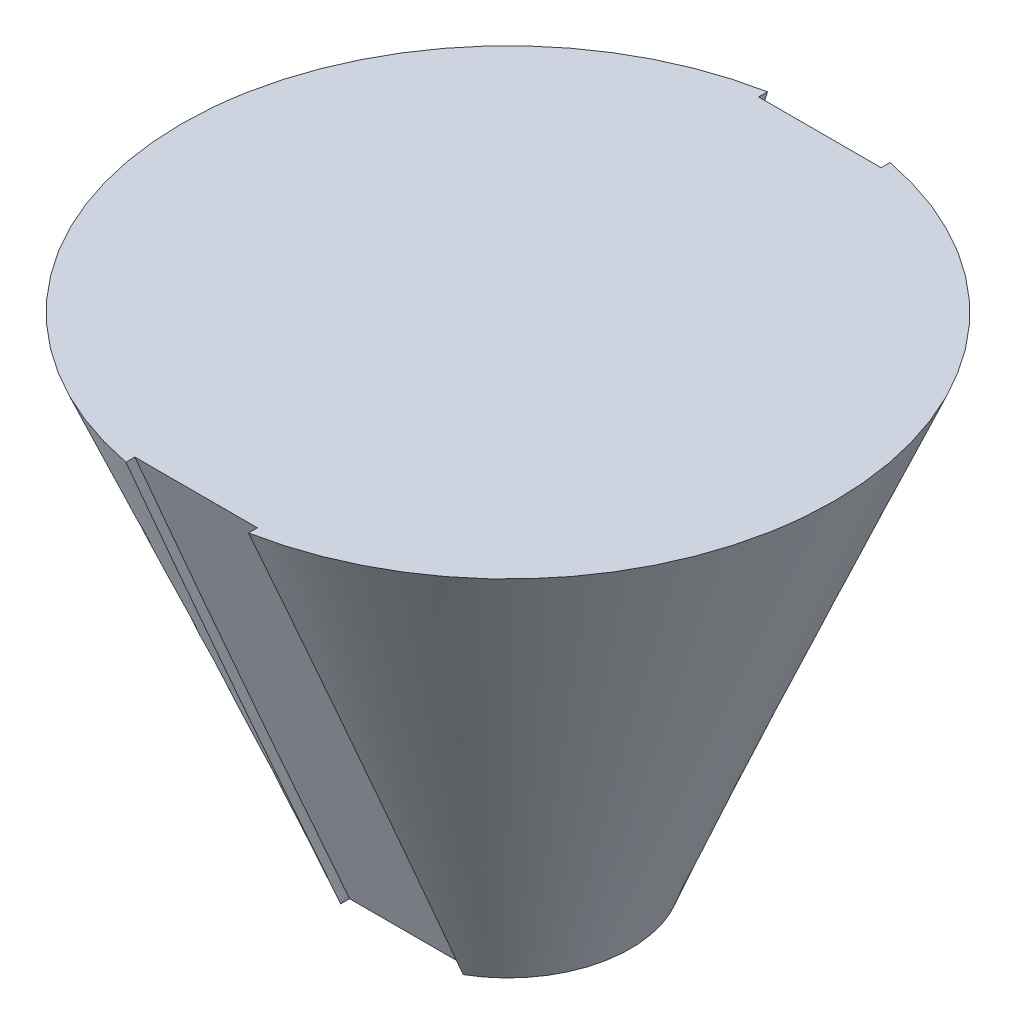
ISO-10303-21;
HEADER;
FILE_DESCRIPTION(('STEP AP214'),'2;1');
FILE_NAME('part.step','',(''),(''),'','','');
FILE_SCHEMA(('AUTOMOTIVE_DESIGN { 1 0 10303 214 1 1 1 1 }'));
ENDSEC;
DATA;
#1=APPLICATION_CONTEXT('core data for automotive mechanical design processes');
#2=APPLICATION_PROTOCOL_DEFINITION('international standard','automotive_design',2000,#1);
#3=PRODUCT_CONTEXT('',#1,'mechanical');
#4=PRODUCT('Part','Part','',(#3));
#5=PRODUCT_RELATED_PRODUCT_CATEGORY('part','',(#4));
#6=PRODUCT_DEFINITION_FORMATION('','',#4);
#7=PRODUCT_DEFINITION_CONTEXT('part definition',#1,'design');
#8=PRODUCT_DEFINITION('design','',#6,#7);
#9=PRODUCT_DEFINITION_SHAPE('','',#8);
#10=(LENGTH_UNIT() NAMED_UNIT(*) SI_UNIT(.MILLI.,.METRE.));
#11=(NAMED_UNIT(*) PLANE_ANGLE_UNIT() SI_UNIT($,.RADIAN.));
#12=(NAMED_UNIT(*) SI_UNIT($,.STERADIAN.) SOLID_ANGLE_UNIT());
#13=UNCERTAINTY_MEASURE_WITH_UNIT(LENGTH_MEASURE(1.E-05),#10,'distance_accuracy_value','');
#14=(GEOMETRIC_REPRESENTATION_CONTEXT(3) GLOBAL_UNCERTAINTY_ASSIGNED_CONTEXT((#13)) GLOBAL_UNIT_ASSIGNED_CONTEXT((#10,
#11,#12)) REPRESENTATION_CONTEXT('',''));
#15=CARTESIAN_POINT('',(0.,0.,0.));
#16=DIRECTION('',(0.,0.,1.));
#17=DIRECTION('',(1.,0.,0.));
#18=AXIS2_PLACEMENT_3D('',#15,#16,#17);
#19=CARTESIAN_POINT('',(0.,0.,0.));
#20=DIRECTION('',(0.,1.,0.));
#21=DIRECTION('',(0.,0.,1.));
#22=AXIS2_PLACEMENT_3D('',#19,#20,#21);
#23=PLANE('',#22);
#24=DIRECTION('',(7.33036834561082E-09,0.,1.));
#25=VECTOR('',#24,1.);
#26=CARTESIAN_POINT('',(19.0499995983419,0.,-1.39643514039585E-07));
#27=LINE('',#26,#25);
#28=CARTESIAN_POINT('',(19.0499998198823,0.,30.2222657953958));
#29=VERTEX_POINT('',#28);
#30=CARTESIAN_POINT('',(19.0499998402116,-1.01759319720562E-07,32.9955678395823));
#31=VERTEX_POINT('',#30);
#32=EDGE_CURVE('E406',#29,#31,#27,.T.);
#33=ORIENTED_EDGE('',*,*,#32,.F.);
#34=DIRECTION('',(1.,0.,0.));
#35=VECTOR('',#34,1.);
#36=CARTESIAN_POINT('',(0.,0.,30.2222657953958));
#37=LINE('',#36,#35);
#38=CARTESIAN_POINT('',(-19.0500008609993,0.,30.2222657953958));
#39=VERTEX_POINT('',#38);
#40=EDGE_CURVE('E155',#39,#29,#37,.T.);
#41=ORIENTED_EDGE('',*,*,#40,.F.);
#42=DIRECTION('',(-7.3303695966274E-09,0.,-1.));
#43=VECTOR('',#42,1.);
#44=CARTESIAN_POINT('',(-19.0500010825397,0.,1.39643548751168E-07));
#45=LINE('',#44,#43);
#46=CARTESIAN_POINT('',(-19.05000084067,5.35392613923436E-07,32.9955681188694));
#47=VERTEX_POINT('',#46);
#48=EDGE_CURVE('E131',#47,#39,#45,.T.);
#49=ORIENTED_EDGE('',*,*,#48,.F.);
#50=CARTESIAN_POINT('',(0.,0.,0.));
#51=DIRECTION('',(0.,1.,0.));
#52=DIRECTION('',(0.,0.,1.));
#53=AXIS2_PLACEMENT_3D('',#50,#51,#52);
#54=CIRCLE('',#53,38.1);
#55=CARTESIAN_POINT('',(-19.05000084067,5.35392613923436E-07,-32.9955681188694));
#56=VERTEX_POINT('',#55);
#57=EDGE_CURVE('E360',#56,#47,#54,.T.);
#58=ORIENTED_EDGE('',*,*,#57,.F.);
#59=DIRECTION('',(-7.33036959662741E-09,0.,1.));
#60=VECTOR('',#59,1.);
#61=CARTESIAN_POINT('',(-19.0500010825397,0.,-1.39643548751168E-07));
#62=LINE('',#61,#60);
#63=CARTESIAN_POINT('',(-19.0500008609993,0.,-30.2222657953958));
#64=VERTEX_POINT('',#63);
#65=EDGE_CURVE('E377',#56,#64,#62,.T.);
#66=ORIENTED_EDGE('',*,*,#65,.T.);
#67=DIRECTION('',(1.,0.,0.));
#68=VECTOR('',#67,1.);
#69=CARTESIAN_POINT('',(0.,0.,-30.2222657953958));
#70=LINE('',#69,#68);
#71=CARTESIAN_POINT('',(19.0499998198823,0.,-30.2222657953958));
#72=VERTEX_POINT('',#71);
#73=EDGE_CURVE('E272',#64,#72,#70,.T.);
#74=ORIENTED_EDGE('',*,*,#73,.T.);
#75=DIRECTION('',(7.33036834561082E-09,0.,-1.));
#76=VECTOR('',#75,1.);
#77=CARTESIAN_POINT('',(19.0499995983419,0.,1.39643514039585E-07));
#78=LINE('',#77,#76);
#79=CARTESIAN_POINT('',(19.0499998402116,-1.01759319720562E-07,-32.9955678395823));
#80=VERTEX_POINT('',#79);
#81=EDGE_CURVE('E379',#72,#80,#78,.T.);
#82=ORIENTED_EDGE('',*,*,#81,.T.);
#83=EDGE_CURVE('E44',#31,#80,#54,.T.);
#84=ORIENTED_EDGE('',*,*,#83,.F.);
#85=EDGE_LOOP('',(#33,#41,#49,#58,#66,#74,#82,#84));
#86=FACE_BOUND('',#85,.T.);
#87=ADVANCED_FACE('F40',(#86),#23,.F.);
#88=CARTESIAN_POINT('',(0.,152.4,0.));
#89=DIRECTION('',(0.,1.,0.));
#90=DIRECTION('',(0.,0.,1.));
#91=AXIS2_PLACEMENT_3D('',#88,#89,#90);
#92=PLANE('',#91);
#93=CARTESIAN_POINT('',(0.,152.4,0.));
#94=DIRECTION('',(0.,1.,0.));
#95=DIRECTION('',(0.,0.,1.));
#96=AXIS2_PLACEMENT_3D('',#93,#94,#95);
#97=CIRCLE('',#96,101.6);
#98=CARTESIAN_POINT('',(-19.0500000000001,152.4,-99.7980836489359));
#99=VERTEX_POINT('',#98);
#100=CARTESIAN_POINT('',(-19.0500000000001,152.4,99.7980836489359));
#101=VERTEX_POINT('',#100);
#102=EDGE_CURVE('E374',#99,#101,#97,.T.);
#103=ORIENTED_EDGE('',*,*,#102,.T.);
#104=CARTESIAN_POINT('',(-19.049999989704,152.4,99.798085382751));
#105=CARTESIAN_POINT('',(-19.0527448059977,152.4,99.3358681915885));
#106=CARTESIAN_POINT('',(-19.0554800138611,152.4,98.8736509437672));
#107=CARTESIAN_POINT('',(-19.0609312127275,152.4,97.9492163348066));
#108=CARTESIAN_POINT('',(-19.0636472037305,152.4,97.4869989736673));
#109=CARTESIAN_POINT('',(-19.0663535863032,152.4,97.0247815558692));
#110=B_SPLINE_CURVE_WITH_KNOTS('',3,(#104,#105,#106,#107,#108,#109),.UNSPECIFIED.,.F.,.F.,(4,2,
4),(0.,1.38667602197148,2.77335204394298),.UNSPECIFIED.);
#111=CARTESIAN_POINT('',(-19.0663534125822,152.400000002331,97.0247815611664));
#112=VERTEX_POINT('',#111);
#113=EDGE_CURVE('E209',#101,#112,#110,.T.);
#114=ORIENTED_EDGE('',*,*,#113,.T.);
#115=DIRECTION('',(-1.,0.,0.));
#116=VECTOR('',#115,1.);
#117=CARTESIAN_POINT('',(0.,152.4,97.0247815601446));
#118=LINE('',#117,#116);
#119=CARTESIAN_POINT('',(19.0663633518773,152.400000002341,97.0247815611709));
#120=VERTEX_POINT('',#119);
#121=EDGE_CURVE('E12',#120,#112,#118,.T.);
#122=ORIENTED_EDGE('',*,*,#121,.F.);
#123=CARTESIAN_POINT('',(19.0663635273933,152.399999995124,97.0247815558696));
#124=CARTESIAN_POINT('',(19.0636571576747,152.399999997562,97.4869986847007));
#125=CARTESIAN_POINT('',(19.0609411795881,152.399999999187,97.9492157568735));
#126=CARTESIAN_POINT('',(19.0554900066788,152.400000000813,98.8736497879025));
#127=CARTESIAN_POINT('',(19.0527548118561,152.400000000813,99.3358667467587));
#128=CARTESIAN_POINT('',(19.0500100086654,152.4,99.7980836489565));
#129=B_SPLINE_CURVE_WITH_KNOTS('',3,(#123,#124,#125,#126,#127,#128),.UNSPECIFIED.,.F.,.F.,(4,2,
4),(0.,1.38667515485952,2.77335030971903),.UNSPECIFIED.);
#130=CARTESIAN_POINT('',(19.0500100086654,152.400000000008,99.7980836489392));
#131=VERTEX_POINT('',#130);
#132=EDGE_CURVE('E206',#120,#131,#129,.T.);
#133=ORIENTED_EDGE('',*,*,#132,.T.);
#134=CARTESIAN_POINT('',(19.0500100086654,152.400000000008,-99.7980836489392));
#135=VERTEX_POINT('',#134);
#136=EDGE_CURVE('E329',#131,#135,#97,.T.);
#137=ORIENTED_EDGE('',*,*,#136,.T.);
#138=CARTESIAN_POINT('',(19.0663635273933,152.399999995124,-97.0247815558696));
#139=CARTESIAN_POINT('',(19.0636571576747,152.399999997562,-97.4869986847007));
#140=CARTESIAN_POINT('',(19.0609411795881,152.399999999187,-97.9492157568735));
#141=CARTESIAN_POINT('',(19.0554900066788,152.400000000813,-98.8736497879025));
#142=CARTESIAN_POINT('',(19.0527548118561,152.400000000813,-99.3358667467587));
#143=CARTESIAN_POINT('',(19.0500100086654,152.4,-99.7980836489565));
#144=B_SPLINE_CURVE_WITH_KNOTS('',3,(#138,#139,#140,#141,#142,#143),.UNSPECIFIED.,.F.,.F.,(4,2,
4),(0.,1.38667515485952,2.77335030971903),.UNSPECIFIED.);
#145=CARTESIAN_POINT('',(19.0663633533574,152.400000002334,-97.0247815611676));
#146=VERTEX_POINT('',#145);
#147=EDGE_CURVE('E582',#146,#135,#144,.T.);
#148=ORIENTED_EDGE('',*,*,#147,.F.);
#149=DIRECTION('',(1.,0.,0.));
#150=VECTOR('',#149,1.);
#151=CARTESIAN_POINT('',(0.,152.4,-97.0247815601446));
#152=LINE('',#151,#150);
#153=CARTESIAN_POINT('',(-19.0663532360007,152.4,-97.0247815601446));
#154=VERTEX_POINT('',#153);
#155=EDGE_CURVE('E64',#154,#146,#152,.T.);
#156=ORIENTED_EDGE('',*,*,#155,.F.);
#157=CARTESIAN_POINT('',(-19.0499999890534,152.4,-99.7980854923182));
#158=CARTESIAN_POINT('',(-19.052744805457,152.4,-99.3358682828946));
#159=CARTESIAN_POINT('',(-19.0554800134296,152.4,-98.873651016812));
#160=CARTESIAN_POINT('',(-19.0609312125129,152.4,-97.949216371329));
#161=CARTESIAN_POINT('',(-19.0636472036236,152.4,-97.4869989919286));
#162=CARTESIAN_POINT('',(-19.0663535863032,152.4,-97.0247815558692));
#163=B_SPLINE_CURVE_WITH_KNOTS('',3,(#157,#158,#159,#160,#161,#162),.UNSPECIFIED.,.F.,.F.,(4,2,
4),(0.,1.38667607675604,2.7733521535121),.UNSPECIFIED.);
#164=EDGE_CURVE('E252',#99,#154,#163,.T.);
#165=ORIENTED_EDGE('',*,*,#164,.F.);
#166=EDGE_LOOP('',(#103,#114,#122,#133,#137,#148,#156,#165));
#167=FACE_BOUND('',#166,.T.);
#168=ADVANCED_FACE('F217',(#167),#92,.T.);
#169=CARTESIAN_POINT('',(-99.0830255987771,152.4,-22.4747422274892));
#170=CARTESIAN_POINT('',(-33.0829934148477,0.,-18.8977656539905));
#171=CARTESIAN_POINT('',(-54.1335411437988,152.4,-220.640793425043));
#172=CARTESIAN_POINT('',(4.71253789313333,0.,-85.0637524836859));
#173=CARTESIAN_POINT('',(144.032510053755,152.4,-175.691308970065));
#174=CARTESIAN_POINT('',(70.8785247228287,0.,-47.2682211757049));
#175=CARTESIAN_POINT('',(99.0830255987771,152.4,22.4747422274891));
#176=CARTESIAN_POINT('',(33.0829934148477,0.,18.8977656539905));
#177=CARTESIAN_POINT('',(54.1335411437988,152.4,220.640793425043));
#178=CARTESIAN_POINT('',(-4.71253789313329,0.,85.0637524836858));
#179=CARTESIAN_POINT('',(-144.032510053755,152.4,175.691308970065));
#180=CARTESIAN_POINT('',(-70.8785247228287,0.,47.2682211757049));
#181=CARTESIAN_POINT('',(-99.0830255987771,152.4,-22.4747422274892));
#182=CARTESIAN_POINT('',(-33.0829934148477,0.,-18.8977656539905));
#183=(BOUNDED_SURFACE() B_SPLINE_SURFACE(3,1,((#169,#170),(#171,#172),(#173,#174),(#175,#176),
(#177,#178),(#179,#180),(#181,#182)),.UNSPECIFIED.,.T.,.F.,.F.) B_SPLINE_SURFACE_WITH_KNOTS((4,
3,4),(2,2),(0.,0.5,1.),(0.,1.),
.UNSPECIFIED.) GEOMETRIC_REPRESENTATION_ITEM() RATIONAL_B_SPLINE_SURFACE(((1.,1.),
(0.333333333333333,0.333333333333333),(0.333333333333333,0.333333333333333),(1.,1.),
(0.333333333333334,0.333333333333334),(0.333333333333334,0.333333333333334),(1.,1.))) REPRESENTATION_ITEM('') SURFACE());
#184=CARTESIAN_POINT('',(19.05,152.4,99.7980836489359));
#185=CARTESIAN_POINT('',(19.1282176505244,147.555548675778,97.6745827568236));
#186=CARTESIAN_POINT('',(19.1985392047488,142.71099174644,95.5510355741117));
#187=CARTESIAN_POINT('',(19.3238028915018,133.021712054414,91.3038685178411));
#188=CARTESIAN_POINT('',(19.3787450276209,128.176989291764,89.1802486442994));
#189=CARTESIAN_POINT('',(19.4736626289873,118.487426786689,84.9329576206853));
#190=CARTESIAN_POINT('',(19.5136381119627,113.64258704441,82.8092864706767));
#191=CARTESIAN_POINT('',(19.5788851779821,103.952825651642,78.5619082672842));
#192=CARTESIAN_POINT('',(19.6041567617929,99.1079040011583,76.4382012139022));
#193=CARTESIAN_POINT('',(19.6513286902379,86.4177481479264,70.8756399511552));
#194=CARTESIAN_POINT('',(19.661450257727,78.5724750289803,67.4367686833917));
#195=CARTESIAN_POINT('',(19.6438085913902,62.8819671311119,60.5590429537049));
#196=CARTESIAN_POINT('',(19.6160453749614,55.0367323521735,57.1201884917745));
#197=CARTESIAN_POINT('',(19.5455463414974,43.2588113264659,51.95749324902));
#198=CARTESIAN_POINT('',(19.5171819990911,39.3260492578465,50.2336192326948));
#199=CARTESIAN_POINT('',(19.4506698412626,31.4605941421013,46.7859014546994));
#200=CARTESIAN_POINT('',(19.4125220268007,27.5279010949688,45.0620576930263));
#201=CARTESIAN_POINT('',(19.3262748968702,19.6626044292629,41.6144093695011));
#202=CARTESIAN_POINT('',(19.2781755761881,15.7300008107375,39.89060480767));
#203=CARTESIAN_POINT('',(19.1717884237739,7.86490814665635,36.4430459055474));
#204=CARTESIAN_POINT('',(19.1135005891508,3.93241910113348,34.7192915652702));
#205=CARTESIAN_POINT('',(19.0499999999999,0.,32.9955678841872));
#206=B_SPLINE_CURVE_WITH_KNOTS('',3,(#184,#185,#186,#187,#188,#189,#190,#191,#192,#193,#194,
#195,#196,#197,#198,#199,#200,#201,#202,#203,#204,#205),.UNSPECIFIED.,.F.,.F.,(4,2,2,2,2,2,2,2,
2,2,4),(0.,15.869986985304,31.7399702656282,47.6099347478038,63.4798984024,89.1774417928696,
114.874973382748,127.757218332238,140.639462017396,153.52171245137,166.403966540591),.UNSPECIFIED.);
#207=CARTESIAN_POINT('',(19.6557108164808,76.1804769342842,66.3882680900178));
#208=VERTEX_POINT('',#207);
#209=EDGE_CURVE('E50',#131,#208,#206,.T.);
#210=EDGE_CURVE('E413',#208,#31,#206,.T.);
#211=CARTESIAN_POINT('',(19.05,152.4,-99.7980836489359));
#212=CARTESIAN_POINT('',(19.1282176505244,147.555548675778,-97.6745827568236));
#213=CARTESIAN_POINT('',(19.1985392047487,142.71099174644,-95.5510355741118));
#214=CARTESIAN_POINT('',(19.3238028915017,133.021712054414,-91.3038685178411));
#215=CARTESIAN_POINT('',(19.3787450276207,128.176989291764,-89.1802486442994));
#216=CARTESIAN_POINT('',(19.4736626289871,118.487426786689,-84.9329576206853));
#217=CARTESIAN_POINT('',(19.5136381119627,113.64258704441,-82.8092864706767));
#218=CARTESIAN_POINT('',(19.5788851779822,103.952825651642,-78.5619082672842));
#219=CARTESIAN_POINT('',(19.604156761793,99.1079040011582,-76.4382012139022));
#220=CARTESIAN_POINT('',(19.651328690238,86.4177481479264,-70.8756399511552));
#221=CARTESIAN_POINT('',(19.661450257727,78.5724750289805,-67.4367686833918));
#222=CARTESIAN_POINT('',(19.6438085913901,62.8819671311122,-60.559042953705));
#223=CARTESIAN_POINT('',(19.6160453749614,55.0367323521739,-57.1201884917747));
#224=CARTESIAN_POINT('',(19.5455463414974,43.2588113264664,-51.9574932490202));
#225=CARTESIAN_POINT('',(19.517181999091,39.3260492578469,-50.233619232695));
#226=CARTESIAN_POINT('',(19.4506698412625,31.4605941421016,-46.7859014546996));
#227=CARTESIAN_POINT('',(19.4125220268007,27.527901094969,-45.0620576930264));
#228=CARTESIAN_POINT('',(19.3262748968701,19.6626044292631,-41.6144093695012));
#229=CARTESIAN_POINT('',(19.2781755761881,15.7300008107376,-39.8906048076701));
#230=CARTESIAN_POINT('',(19.1717884237739,7.86490814665641,-36.4430459055474));
#231=CARTESIAN_POINT('',(19.1135005891508,3.93241910113351,-34.7192915652702));
#232=CARTESIAN_POINT('',(19.05,0.,-32.9955678841871));
#233=B_SPLINE_CURVE_WITH_KNOTS('',3,(#211,#212,#213,#214,#215,#216,#217,#218,#219,#220,#221,
#222,#223,#224,#225,#226,#227,#228,#229,#230,#231,#232),.UNSPECIFIED.,.F.,.F.,(4,2,2,2,2,2,2,2,
2,2,4),(0.,15.869986985304,31.7399702656282,47.6099347478038,63.4798984024001,89.1774417928694,
114.874973382747,127.757218332238,140.639462017396,153.52171245137,166.403966540591),.UNSPECIFIED.);
#234=EDGE_CURVE('E373',#135,#80,#233,.T.);
#235=ORIENTED_EDGE('',*,*,#136,.F.);
#236=ORIENTED_EDGE('',*,*,#209,.T.);
#237=ORIENTED_EDGE('',*,*,#210,.T.);
#238=ORIENTED_EDGE('',*,*,#83,.T.);
#239=ORIENTED_EDGE('',*,*,#234,.F.);
#240=EDGE_LOOP('',(#235,#236,#237,#238,#239));
#241=FACE_BOUND('',#240,.T.);
#242=ADVANCED_FACE('F221',(#241),#183,.T.);
#243=CARTESIAN_POINT('',(-19.05,0.,32.9955678841871));
#244=CARTESIAN_POINT('',(-19.0999113516366,3.09057479867315,34.3502802969857));
#245=CARTESIAN_POINT('',(-19.1465970583467,6.18119238428096,35.7050114648687));
#246=CARTESIAN_POINT('',(-19.2336421899771,12.3625018500748,38.4145063666763));
#247=CARTESIAN_POINT('',(-19.2740016158585,15.4531937302495,39.769270100596));
#248=CARTESIAN_POINT('',(-19.3857779881531,24.7253638594093,43.8336027201933));
#249=CARTESIAN_POINT('',(-19.4478930524012,30.9069380398862,46.5432136561662));
#250=CARTESIAN_POINT('',(-19.5480243998275,43.2702176043746,51.9624930394387));
#251=CARTESIAN_POINT('',(-19.5860408013793,49.4519229875925,54.6721614863904));
#252=CARTESIAN_POINT('',(-19.6383884154189,61.8154143770957,60.0915337203447));
#253=CARTESIAN_POINT('',(-19.6527196410543,67.9972003833344,62.8012375073267));
#254=CARTESIAN_POINT('',(-19.6579925219509,80.6963465224223,68.3677395424663));
#255=CARTESIAN_POINT('',(-19.6476222952635,87.2137071443778,71.224538005017));
#256=CARTESIAN_POINT('',(-19.6006063180213,100.248341760654,76.9380969580453));
#257=CARTESIAN_POINT('',(-19.5639605948476,106.765615755057,79.7948574485593));
#258=CARTESIAN_POINT('',(-19.4639320386123,119.802573978137,85.5094349237671));
#259=CARTESIAN_POINT('',(-19.400538628481,126.322258139777,88.3672518790761));
#260=CARTESIAN_POINT('',(-19.2847946877237,136.101580115779,92.6538877745516));
#261=CARTESIAN_POINT('',(-19.2427710284276,139.361322644294,94.0827526147757));
#262=CARTESIAN_POINT('',(-19.151694034527,145.880725954031,96.9404464623838));
#263=CARTESIAN_POINT('',(-19.1026406984691,149.140386735236,98.3692754697603));
#264=CARTESIAN_POINT('',(-19.0499999999998,152.4,99.7980836489359));
#265=B_SPLINE_CURVE_WITH_KNOTS('',3,(#243,#244,#245,#246,#247,#248,#249,#250,#251,#252,#253,
#254,#255,#256,#257,#258,#259,#260,#261,#262,#263,#264),.UNSPECIFIED.,.F.,.F.,(4,2,2,2,2,2,2,2,
2,2,4),(0.,10.1244474617444,20.2488933853276,40.4977805058589,60.7465681621652,80.9953445784015,
102.34328279123,123.69119875792,145.047564439592,155.725764190048,166.403966148381),.UNSPECIFIED.);
#266=CARTESIAN_POINT('',(-19.6557059324347,76.1995659396247,66.3966355019614));
#267=VERTEX_POINT('',#266);
#268=EDGE_CURVE('E145',#47,#267,#265,.T.);
#269=EDGE_CURVE('E414',#267,#101,#265,.T.);
#270=CARTESIAN_POINT('',(-19.05,1.11670672708897E-12,-32.9955678841876));
#271=CARTESIAN_POINT('',(-19.0999113516367,3.09057479867424,-34.3502802969861));
#272=CARTESIAN_POINT('',(-19.1465970583468,6.18119238428201,-35.7050114648691));
#273=CARTESIAN_POINT('',(-19.2336421899771,12.3625018500758,-38.4145063666768));
#274=CARTESIAN_POINT('',(-19.2740016158585,15.4531937302505,-39.7692701005964));
#275=CARTESIAN_POINT('',(-19.3857779881531,24.7253638594102,-43.8336027201936));
#276=CARTESIAN_POINT('',(-19.4478930524013,30.906938039887,-46.5432136561665));
#277=CARTESIAN_POINT('',(-19.5480243998275,43.2702176043753,-51.962493039439));
#278=CARTESIAN_POINT('',(-19.5860408013793,49.451922987593,-54.6721614863907));
#279=CARTESIAN_POINT('',(-19.638388415419,61.8154143770962,-60.0915337203449));
#280=CARTESIAN_POINT('',(-19.6527196410544,67.9972003833348,-62.8012375073269));
#281=CARTESIAN_POINT('',(-19.6579925219511,80.6963465224226,-68.3677395424664));
#282=CARTESIAN_POINT('',(-19.6476222952636,87.2137071443781,-71.2245380050171));
#283=CARTESIAN_POINT('',(-19.6006063180214,100.248341760654,-76.9380969580454));
#284=CARTESIAN_POINT('',(-19.5639605948477,106.765615755058,-79.7948574485594));
#285=CARTESIAN_POINT('',(-19.4639320386125,119.802573978137,-85.5094349237672));
#286=CARTESIAN_POINT('',(-19.4005386284812,126.322258139777,-88.3672518790762));
#287=CARTESIAN_POINT('',(-19.2847946877239,136.101580115779,-92.6538877745516));
#288=CARTESIAN_POINT('',(-19.2427710284277,139.361322644294,-94.0827526147758));
#289=CARTESIAN_POINT('',(-19.1516940345272,145.880725954031,-96.9404464623838));
#290=CARTESIAN_POINT('',(-19.1026406984693,149.140386735236,-98.3692754697603));
#291=CARTESIAN_POINT('',(-19.0500000000001,152.4,-99.7980836489358));
#292=B_SPLINE_CURVE_WITH_KNOTS('',3,(#270,#271,#272,#273,#274,#275,#276,#277,#278,#279,#280,
#281,#282,#283,#284,#285,#286,#287,#288,#289,#290,#291),.UNSPECIFIED.,.F.,.F.,(4,2,2,2,2,2,2,2,
2,2,4),(0.,10.1244474617443,20.2488933853274,40.4977805058585,60.7465681621646,80.9953445784006,
102.343282791229,123.691198757919,145.047564439591,155.725764190047,166.403966148379),.UNSPECIFIED.);
#293=EDGE_CURVE('E371',#56,#99,#292,.T.);
#294=ORIENTED_EDGE('',*,*,#57,.T.);
#295=ORIENTED_EDGE('',*,*,#268,.T.);
#296=ORIENTED_EDGE('',*,*,#269,.T.);
#297=ORIENTED_EDGE('',*,*,#102,.F.);
#298=ORIENTED_EDGE('',*,*,#293,.F.);
#299=EDGE_LOOP('',(#294,#295,#296,#297,#298));
#300=FACE_BOUND('',#299,.T.);
#301=ADVANCED_FACE('F260',(#300),#183,.T.);
#302=CARTESIAN_POINT('',(-19.05,1.0197133513897,-30.6692435987536));
#303=CARTESIAN_POINT('',(-19.4601982062371,26.4181443243279,-41.8023084640396));
#304=CARTESIAN_POINT('',(-19.655703667574,51.8181447882808,-52.9360612948654));
#305=CARTESIAN_POINT('',(-19.6557081972953,102.620413793746,-75.2045611381894));
#306=CARTESIAN_POINT('',(-19.4601977311479,128.021311794774,-86.3387073924707));
#307=CARTESIAN_POINT('',(-19.0500000000001,153.419713351389,-97.471759363502));
#308=B_SPLINE_CURVE_WITH_KNOTS('',3,(#302,#303,#304,#305,#306,#307),.UNSPECIFIED.,.F.,.F.,(4,2,
4),(0.,0.5,1.),.UNSPECIFIED.);
#309=DIRECTION('',(0.,-0.401461949365585,-0.915875702926759));
#310=VECTOR('',#309,1.);
#311=SURFACE_OF_LINEAR_EXTRUSION('',#308,#310);
#312=ORIENTED_EDGE('',*,*,#164,.T.);
#313=CARTESIAN_POINT('',(-19.0663535862037,152.400000004678,-97.0247815621951));
#314=CARTESIAN_POINT('',(-19.46539570444,127.341436925953,-86.0406932740817));
#315=CARTESIAN_POINT('',(-19.6557081669849,102.280473215438,-75.0555527009093));
#316=CARTESIAN_POINT('',(-19.655703667574,51.8181447882808,-52.9360612948654));
#317=CARTESIAN_POINT('',(-19.4601982062371,26.4181443243279,-41.8023084640396));
#318=CARTESIAN_POINT('',(-19.05,1.0197133513897,-30.6692435987536));
#319=B_SPLINE_CURVE_WITH_KNOTS('',3,(#313,#314,#315,#316,#317,#318),.UNSPECIFIED.,.F.,.F.,(4,2,
4),(0.,0.493308555208996,0.993308555208996),.UNSPECIFIED.);
#320=CARTESIAN_POINT('',(-19.05000084067,1.01971388678121,-30.6692438334354));
#321=VERTEX_POINT('',#320);
#322=EDGE_CURVE('E58',#321,#154,#319,.F.);
#323=ORIENTED_EDGE('',*,*,#322,.F.);
#324=DIRECTION('',(0.,-0.401461949365585,-0.915875702926759));
#325=VECTOR('',#324,1.);
#326=CARTESIAN_POINT('',(-19.05000084067,1.01971388678121,-30.6692438334354));
#327=LINE('',#326,#325);
#328=EDGE_CURVE('E569',#321,#56,#327,.T.);
#329=ORIENTED_EDGE('',*,*,#328,.T.);
#330=ORIENTED_EDGE('',*,*,#293,.T.);
#331=EDGE_LOOP('',(#312,#323,#329,#330));
#332=FACE_BOUND('',#331,.T.);
#333=ADVANCED_FACE('F255',(#332),#311,.F.);
#334=CARTESIAN_POINT('',(19.0500100086654,153.419713351396,-97.4717593635052));
#335=CARTESIAN_POINT('',(19.4602052928948,128.021358351454,-86.3387277999731));
#336=CARTESIAN_POINT('',(19.6557121058377,102.620671441609,-75.2046740747081));
#337=CARTESIAN_POINT('',(19.6557096087664,51.818926146645,-52.936403792926));
#338=CARTESIAN_POINT('',(19.4601983815566,26.4180600213286,-41.8022715109397));
#339=CARTESIAN_POINT('',(19.0499998402116,1.01971324962925,-30.6692435541483));
#340=B_SPLINE_CURVE_WITH_KNOTS('',3,(#334,#335,#336,#337,#338,#339),.UNSPECIFIED.,.F.,.F.,(4,2,
4),(0.,0.5,1.),.UNSPECIFIED.);
#341=DIRECTION('',(0.,-0.401461949365585,-0.915875702926759));
#342=VECTOR('',#341,1.);
#343=SURFACE_OF_LINEAR_EXTRUSION('',#340,#342);
#344=ORIENTED_EDGE('',*,*,#147,.T.);
#345=ORIENTED_EDGE('',*,*,#234,.T.);
#346=DIRECTION('',(0.,-0.401461949365585,-0.915875702926759));
#347=VECTOR('',#346,1.);
#348=CARTESIAN_POINT('',(19.0499998402116,1.01971324962925,-30.6692435541483));
#349=LINE('',#348,#347);
#350=CARTESIAN_POINT('',(19.0499998402116,1.01971324962926,-30.6692435541483));
#351=VERTEX_POINT('',#350);
#352=EDGE_CURVE('E577',#351,#80,#349,.T.);
#353=ORIENTED_EDGE('',*,*,#352,.F.);
#354=CARTESIAN_POINT('',(19.0499998402116,1.01971324962925,-30.6692435541483));
#355=CARTESIAN_POINT('',(19.4601983815566,26.4180600213286,-41.8022715109397));
#356=CARTESIAN_POINT('',(19.6557096087664,51.818926146645,-52.936403792926));
#357=CARTESIAN_POINT('',(19.6557120891286,102.280733715168,-75.0556668875058));
#358=CARTESIAN_POINT('',(19.4654031791525,127.341487836728,-86.0407155901437));
#359=CARTESIAN_POINT('',(19.0663635271639,152.400000004655,-97.0247815621852));
#360=B_SPLINE_CURVE_WITH_KNOTS('',3,(#354,#355,#356,#357,#358,#359),.UNSPECIFIED.,.F.,.F.,(4,2,
4),(0.00669145763531542,0.506691457635315,1.),.UNSPECIFIED.);
#361=EDGE_CURVE('E301',#146,#351,#360,.F.);
#362=ORIENTED_EDGE('',*,*,#361,.F.);
#363=EDGE_LOOP('',(#344,#345,#353,#362));
#364=FACE_BOUND('',#363,.T.);
#365=ADVANCED_FACE('F259',(#364),#343,.F.);
#366=CARTESIAN_POINT('',(-19.6557059324347,77.2192792910133,-64.0703112165274));
#367=DIRECTION('',(0.,0.401461949365585,0.915875702926759));
#368=DIRECTION('',(0.,-0.915875702926759,0.401461949365585));
#369=AXIS2_PLACEMENT_3D('',#366,#367,#368);
#370=PLANE('',#369);
#371=ORIENTED_EDGE('',*,*,#155,.T.);
#372=ORIENTED_EDGE('',*,*,#361,.T.);
#373=DIRECTION('',(1.82591889672516E-08,0.915875702926759,-0.401461949365585));
#374=VECTOR('',#373,1.);
#375=CARTESIAN_POINT('',(19.0499987620126,-53.0624382223657,-6.96305079627774));
#376=LINE('',#375,#374);
#377=EDGE_CURVE('E380',#72,#351,#376,.T.);
#378=ORIENTED_EDGE('',*,*,#377,.F.);
#379=ORIENTED_EDGE('',*,*,#73,.F.);
#380=DIRECTION('',(1.82591889672516E-08,0.915875702926759,-0.401461949365585));
#381=VECTOR('',#380,1.);
#382=CARTESIAN_POINT('',(-19.0500019188689,-53.0624375852138,-6.96305107556482));
#383=LINE('',#382,#381);
#384=EDGE_CURVE('E253',#64,#321,#383,.T.);
#385=ORIENTED_EDGE('',*,*,#384,.T.);
#386=ORIENTED_EDGE('',*,*,#322,.T.);
#387=EDGE_LOOP('',(#371,#372,#378,#379,#385,#386));
#388=FACE_BOUND('',#387,.T.);
#389=ADVANCED_FACE('F487',(#388),#370,.F.);
#390=CARTESIAN_POINT('',(19.0499987620126,-53.0624382223657,-6.96305079627774));
#391=DIRECTION('',(1.,-1.67231480786206E-08,7.33036834561082E-09));
#392=DIRECTION('',(1.67231480786206E-08,1.,0.));
#393=AXIS2_PLACEMENT_3D('',#390,#391,#392);
#394=PLANE('',#393);
#395=ORIENTED_EDGE('',*,*,#377,.T.);
#396=ORIENTED_EDGE('',*,*,#352,.T.);
#397=ORIENTED_EDGE('',*,*,#81,.F.);
#398=EDGE_LOOP('',(#395,#396,#397));
#399=FACE_BOUND('',#398,.T.);
#400=ADVANCED_FACE('F493',(#399),#394,.F.);
#401=CARTESIAN_POINT('',(-19.0500019188689,-54.0821509366024,-9.28937536099879));
#402=DIRECTION('',(-1.,1.67231475302541E-08,-7.3303695966274E-09));
#403=DIRECTION('',(-1.67231475302541E-08,-1.,0.));
#404=AXIS2_PLACEMENT_3D('',#401,#402,#403);
#405=PLANE('',#404);
#406=ORIENTED_EDGE('',*,*,#328,.F.);
#407=ORIENTED_EDGE('',*,*,#384,.F.);
#408=ORIENTED_EDGE('',*,*,#65,.F.);
#409=EDGE_LOOP('',(#406,#407,#408));
#410=FACE_BOUND('',#409,.T.);
#411=ADVANCED_FACE('F393',(#410),#405,.F.);
#412=CARTESIAN_POINT('',(-19.05,1.0197133513897,30.6692435987536));
#413=CARTESIAN_POINT('',(-19.4601982062371,26.4181443243279,41.8023084640396));
#414=CARTESIAN_POINT('',(-19.655703667574,51.8181447882808,52.9360612948654));
#415=CARTESIAN_POINT('',(-19.6557081972953,102.620413793746,75.2045611381894));
#416=CARTESIAN_POINT('',(-19.4601977311479,128.021311794774,86.3387073924707));
#417=CARTESIAN_POINT('',(-19.0500000000001,153.419713351389,97.471759363502));
#418=B_SPLINE_CURVE_WITH_KNOTS('',3,(#412,#413,#414,#415,#416,#417),.UNSPECIFIED.,.F.,.F.,(4,2,
4),(0.,0.5,1.),.UNSPECIFIED.);
#419=DIRECTION('',(0.,-0.401461949365585,0.915875702926759));
#420=VECTOR('',#419,1.);
#421=SURFACE_OF_LINEAR_EXTRUSION('',#418,#420);
#422=ORIENTED_EDGE('',*,*,#269,.F.);
#423=ORIENTED_EDGE('',*,*,#268,.F.);
#424=DIRECTION('',(0.,-0.401461949365585,0.915875702926759));
#425=VECTOR('',#424,1.);
#426=CARTESIAN_POINT('',(-19.05000084067,1.01971388678121,30.6692438334354));
#427=LINE('',#426,#425);
#428=CARTESIAN_POINT('',(-19.05000084067,1.0197138867812,30.6692438334354));
#429=VERTEX_POINT('',#428);
#430=EDGE_CURVE('E129',#429,#47,#427,.T.);
#431=ORIENTED_EDGE('',*,*,#430,.F.);
#432=CARTESIAN_POINT('',(-19.05,1.0197133513897,30.6692435987536));
#433=CARTESIAN_POINT('',(-19.4601982062371,26.4181443243279,41.8023084640396));
#434=CARTESIAN_POINT('',(-19.655703667574,51.8181447882808,52.9360612948654));
#435=CARTESIAN_POINT('',(-19.6557081669849,102.280473215429,75.0555527009053));
#436=CARTESIAN_POINT('',(-19.4653957044401,127.341436925935,86.0406932740737));
#437=CARTESIAN_POINT('',(-19.0663535862041,152.400000004651,97.024781562183));
#438=B_SPLINE_CURVE_WITH_KNOTS('',3,(#432,#433,#434,#435,#436,#437),.UNSPECIFIED.,.F.,.F.,(4,2,
4),(0.,0.5,0.993308555208816),.UNSPECIFIED.);
#439=EDGE_CURVE('E141',#429,#112,#438,.T.);
#440=ORIENTED_EDGE('',*,*,#439,.T.);
#441=ORIENTED_EDGE('',*,*,#113,.F.);
#442=EDGE_LOOP('',(#422,#423,#431,#440,#441));
#443=FACE_BOUND('',#442,.T.);
#444=ADVANCED_FACE('F140',(#443),#421,.T.);
#445=CARTESIAN_POINT('',(19.0500100086654,153.419713351396,97.4717593635052));
#446=CARTESIAN_POINT('',(19.4602052928948,128.021358351454,86.3387277999731));
#447=CARTESIAN_POINT('',(19.6557121058377,102.620671441609,75.2046740747081));
#448=CARTESIAN_POINT('',(19.6557096087664,51.818926146645,52.936403792926));
#449=CARTESIAN_POINT('',(19.4601983815566,26.4180600213286,41.8022715109397));
#450=CARTESIAN_POINT('',(19.0499998402116,1.01971324962925,30.6692435541483));
#451=B_SPLINE_CURVE_WITH_KNOTS('',3,(#445,#446,#447,#448,#449,#450),.UNSPECIFIED.,.F.,.F.,(4,2,
4),(0.,0.5,1.),.UNSPECIFIED.);
#452=DIRECTION('',(0.,-0.401461949365585,0.915875702926759));
#453=VECTOR('',#452,1.);
#454=SURFACE_OF_LINEAR_EXTRUSION('',#451,#453);
#455=CARTESIAN_POINT('',(19.0663635271635,152.400000004683,97.0247815621973));
#456=CARTESIAN_POINT('',(19.4654031791524,127.341487836746,86.0407155901517));
#457=CARTESIAN_POINT('',(19.6557120891286,102.280733715177,75.0556668875098));
#458=CARTESIAN_POINT('',(19.6557096087664,51.818926146645,52.936403792926));
#459=CARTESIAN_POINT('',(19.4601983815566,26.4180600213286,41.8022715109397));
#460=CARTESIAN_POINT('',(19.0499998402116,1.01971324962925,30.6692435541483));
#461=B_SPLINE_CURVE_WITH_KNOTS('',3,(#455,#456,#457,#458,#459,#460),.UNSPECIFIED.,.F.,.F.,(4,2,
4),(0.00669145763513446,0.5,1.),.UNSPECIFIED.);
#462=CARTESIAN_POINT('',(19.0499998402116,1.01971324962925,30.6692435541483));
#463=VERTEX_POINT('',#462);
#464=EDGE_CURVE('E149',#120,#463,#461,.T.);
#465=ORIENTED_EDGE('',*,*,#464,.T.);
#466=DIRECTION('',(0.,-0.401461949365585,0.915875702926759));
#467=VECTOR('',#466,1.);
#468=CARTESIAN_POINT('',(19.0499998402116,1.01971324962925,30.6692435541483));
#469=LINE('',#468,#467);
#470=EDGE_CURVE('E148',#463,#31,#469,.T.);
#471=ORIENTED_EDGE('',*,*,#470,.T.);
#472=ORIENTED_EDGE('',*,*,#210,.F.);
#473=ORIENTED_EDGE('',*,*,#209,.F.);
#474=ORIENTED_EDGE('',*,*,#132,.F.);
#475=EDGE_LOOP('',(#465,#471,#472,#473,#474));
#476=FACE_BOUND('',#475,.T.);
#477=ADVANCED_FACE('F175',(#476),#454,.T.);
#478=CARTESIAN_POINT('',(-19.6557059324347,77.2192792910133,64.0703112165274));
#479=DIRECTION('',(0.,0.401461949365585,-0.915875702926759));
#480=DIRECTION('',(0.,-0.915875702926759,-0.401461949365585));
#481=AXIS2_PLACEMENT_3D('',#478,#479,#480);
#482=PLANE('',#481);
#483=ORIENTED_EDGE('',*,*,#121,.T.);
#484=ORIENTED_EDGE('',*,*,#439,.F.);
#485=DIRECTION('',(1.82591889672516E-08,0.915875702926759,0.401461949365585));
#486=VECTOR('',#485,1.);
#487=CARTESIAN_POINT('',(-19.050001817135,-47.9594921778405,9.19985941560882));
#488=LINE('',#487,#486);
#489=EDGE_CURVE('E126',#39,#429,#488,.T.);
#490=ORIENTED_EDGE('',*,*,#489,.F.);
#491=ORIENTED_EDGE('',*,*,#40,.T.);
#492=DIRECTION('',(1.82591889672516E-08,0.915875702926759,0.401461949365585));
#493=VECTOR('',#492,1.);
#494=CARTESIAN_POINT('',(19.0499988637466,-47.9594928149925,9.19985913632174));
#495=LINE('',#494,#493);
#496=EDGE_CURVE('E135',#29,#463,#495,.T.);
#497=ORIENTED_EDGE('',*,*,#496,.T.);
#498=ORIENTED_EDGE('',*,*,#464,.F.);
#499=EDGE_LOOP('',(#483,#484,#490,#491,#497,#498));
#500=FACE_BOUND('',#499,.T.);
#501=ADVANCED_FACE('F152',(#500),#482,.F.);
#502=CARTESIAN_POINT('',(19.0499988637466,-47.9594928149925,9.19985913632174));
#503=DIRECTION('',(-1.,1.67231480786206E-08,7.33036834561082E-09));
#504=DIRECTION('',(-1.67231480786206E-08,-1.,0.));
#505=AXIS2_PLACEMENT_3D('',#502,#503,#504);
#506=PLANE('',#505);
#507=ORIENTED_EDGE('',*,*,#32,.T.);
#508=ORIENTED_EDGE('',*,*,#470,.F.);
#509=ORIENTED_EDGE('',*,*,#496,.F.);
#510=EDGE_LOOP('',(#507,#508,#509));
#511=FACE_BOUND('',#510,.T.);
#512=ADVANCED_FACE('F174',(#511),#506,.T.);
#513=CARTESIAN_POINT('',(-19.050001817135,-48.9792055292291,11.5261837010428));
#514=DIRECTION('',(1.,-1.67231475302541E-08,-7.3303695966274E-09));
#515=DIRECTION('',(1.67231475302541E-08,1.,0.));
#516=AXIS2_PLACEMENT_3D('',#513,#514,#515);
#517=PLANE('',#516);
#518=ORIENTED_EDGE('',*,*,#48,.T.);
#519=ORIENTED_EDGE('',*,*,#489,.T.);
#520=ORIENTED_EDGE('',*,*,#430,.T.);
#521=EDGE_LOOP('',(#518,#519,#520));
#522=FACE_BOUND('',#521,.T.);
#523=ADVANCED_FACE('F128',(#522),#517,.T.);
#524=CLOSED_SHELL('',(#87,#168,#242,#301,#333,#365,#389,#400,#411,#444,#477,#501,#512,#523));
#525=MANIFOLD_SOLID_BREP('B2',#524);
#526=ADVANCED_BREP_SHAPE_REPRESENTATION('',(#18,#525),#14);
#527=SHAPE_DEFINITION_REPRESENTATION(#9,#526);
ENDSEC;
END-ISO-10303-21;
